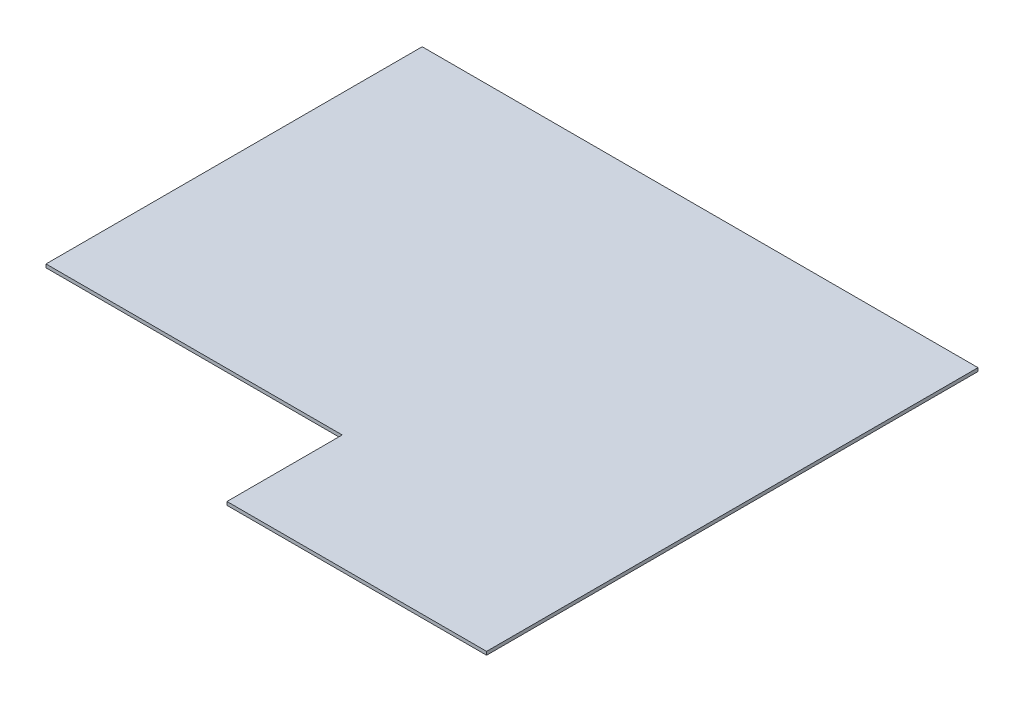
ISO-10303-21;
HEADER;
FILE_DESCRIPTION(('STEP AP214'),'2;1');
FILE_NAME('part.step','',(''),(''),'','','');
FILE_SCHEMA(('AUTOMOTIVE_DESIGN { 1 0 10303 214 1 1 1 1 }'));
ENDSEC;
DATA;
#1=APPLICATION_CONTEXT('core data for automotive mechanical design processes');
#2=APPLICATION_PROTOCOL_DEFINITION('international standard','automotive_design',2000,#1);
#3=PRODUCT_CONTEXT('',#1,'mechanical');
#4=PRODUCT('Part','Part','',(#3));
#5=PRODUCT_RELATED_PRODUCT_CATEGORY('part','',(#4));
#6=PRODUCT_DEFINITION_FORMATION('','',#4);
#7=PRODUCT_DEFINITION_CONTEXT('part definition',#1,'design');
#8=PRODUCT_DEFINITION('design','',#6,#7);
#9=PRODUCT_DEFINITION_SHAPE('','',#8);
#10=(LENGTH_UNIT() NAMED_UNIT(*) SI_UNIT(.MILLI.,.METRE.));
#11=(NAMED_UNIT(*) PLANE_ANGLE_UNIT() SI_UNIT($,.RADIAN.));
#12=(NAMED_UNIT(*) SI_UNIT($,.STERADIAN.) SOLID_ANGLE_UNIT());
#13=UNCERTAINTY_MEASURE_WITH_UNIT(LENGTH_MEASURE(1.E-05),#10,'distance_accuracy_value','');
#14=(GEOMETRIC_REPRESENTATION_CONTEXT(3) GLOBAL_UNCERTAINTY_ASSIGNED_CONTEXT((#13)) GLOBAL_UNIT_ASSIGNED_CONTEXT((#10,
#11,#12)) REPRESENTATION_CONTEXT('',''));
#15=CARTESIAN_POINT('',(0.,0.,0.));
#16=DIRECTION('',(0.,0.,1.));
#17=DIRECTION('',(1.,0.,0.));
#18=AXIS2_PLACEMENT_3D('',#15,#16,#17);
#19=CARTESIAN_POINT('',(0.,100.,-3400.));
#20=DIRECTION('',(1.,0.,0.));
#21=DIRECTION('',(0.,0.,-1.));
#22=AXIS2_PLACEMENT_3D('',#19,#20,#21);
#23=PLANE('',#22);
#24=DIRECTION('',(0.,0.,1.));
#25=VECTOR('',#24,1.);
#26=CARTESIAN_POINT('',(0.,0.,-3400.));
#27=LINE('',#26,#25);
#28=CARTESIAN_POINT('',(0.,0.,-14500.));
#29=VERTEX_POINT('',#28);
#30=CARTESIAN_POINT('',(0.,0.,-3400.));
#31=VERTEX_POINT('',#30);
#32=EDGE_CURVE('E118',#29,#31,#27,.T.);
#33=ORIENTED_EDGE('',*,*,#32,.T.);
#34=DIRECTION('',(0.,-1.,0.));
#35=VECTOR('',#34,1.);
#36=CARTESIAN_POINT('',(0.,100.,-3400.));
#37=LINE('',#36,#35);
#38=CARTESIAN_POINT('',(0.,100.,-3400.));
#39=VERTEX_POINT('',#38);
#40=EDGE_CURVE('E11',#39,#31,#37,.T.);
#41=ORIENTED_EDGE('',*,*,#40,.F.);
#42=DIRECTION('',(0.,0.,1.));
#43=VECTOR('',#42,1.);
#44=CARTESIAN_POINT('',(0.,100.,-3400.));
#45=LINE('',#44,#43);
#46=CARTESIAN_POINT('',(0.,100.,-14500.));
#47=VERTEX_POINT('',#46);
#48=EDGE_CURVE('E128',#47,#39,#45,.T.);
#49=ORIENTED_EDGE('',*,*,#48,.F.);
#50=DIRECTION('',(0.,-1.,0.));
#51=VECTOR('',#50,1.);
#52=CARTESIAN_POINT('',(0.,100.,-14500.));
#53=LINE('',#52,#51);
#54=EDGE_CURVE('E114',#47,#29,#53,.T.);
#55=ORIENTED_EDGE('',*,*,#54,.T.);
#56=EDGE_LOOP('',(#33,#41,#49,#55));
#57=FACE_BOUND('',#56,.T.);
#58=ADVANCED_FACE('F34',(#57),#23,.F.);
#59=CARTESIAN_POINT('',(8740.,100.,-3400.));
#60=DIRECTION('',(0.,0.,-1.));
#61=DIRECTION('',(-1.,0.,0.));
#62=AXIS2_PLACEMENT_3D('',#59,#60,#61);
#63=PLANE('',#62);
#64=DIRECTION('',(1.,0.,0.));
#65=VECTOR('',#64,1.);
#66=CARTESIAN_POINT('',(8740.,0.,-3400.));
#67=LINE('',#66,#65);
#68=CARTESIAN_POINT('',(8740.,0.,-3400.));
#69=VERTEX_POINT('',#68);
#70=EDGE_CURVE('E121',#31,#69,#67,.T.);
#71=ORIENTED_EDGE('',*,*,#70,.T.);
#72=DIRECTION('',(0.,-1.,0.));
#73=VECTOR('',#72,1.);
#74=CARTESIAN_POINT('',(8740.,100.,-3400.));
#75=LINE('',#74,#73);
#76=CARTESIAN_POINT('',(8740.,100.,-3400.));
#77=VERTEX_POINT('',#76);
#78=EDGE_CURVE('E42',#77,#69,#75,.T.);
#79=ORIENTED_EDGE('',*,*,#78,.F.);
#80=DIRECTION('',(1.,0.,0.));
#81=VECTOR('',#80,1.);
#82=CARTESIAN_POINT('',(8740.,100.,-3400.));
#83=LINE('',#82,#81);
#84=EDGE_CURVE('E87',#39,#77,#83,.T.);
#85=ORIENTED_EDGE('',*,*,#84,.F.);
#86=ORIENTED_EDGE('',*,*,#40,.T.);
#87=EDGE_LOOP('',(#71,#79,#85,#86));
#88=FACE_BOUND('',#87,.T.);
#89=ADVANCED_FACE('F152',(#88),#63,.F.);
#90=CARTESIAN_POINT('',(8740.,100.,7.81617874628674E-13));
#91=DIRECTION('',(1.,0.,0.));
#92=DIRECTION('',(0.,0.,-1.));
#93=AXIS2_PLACEMENT_3D('',#90,#91,#92);
#94=PLANE('',#93);
#95=DIRECTION('',(0.,0.,1.));
#96=VECTOR('',#95,1.);
#97=CARTESIAN_POINT('',(8740.,0.,7.81617874628674E-13));
#98=LINE('',#97,#96);
#99=CARTESIAN_POINT('',(8740.,0.,7.81617874628674E-13));
#100=VERTEX_POINT('',#99);
#101=EDGE_CURVE('E123',#69,#100,#98,.T.);
#102=ORIENTED_EDGE('',*,*,#101,.T.);
#103=DIRECTION('',(0.,-1.,0.));
#104=VECTOR('',#103,1.);
#105=CARTESIAN_POINT('',(8740.,100.,7.81617874628674E-13));
#106=LINE('',#105,#104);
#107=CARTESIAN_POINT('',(8740.,100.,7.81617874628674E-13));
#108=VERTEX_POINT('',#107);
#109=EDGE_CURVE('E109',#108,#100,#106,.T.);
#110=ORIENTED_EDGE('',*,*,#109,.F.);
#111=DIRECTION('',(0.,0.,1.));
#112=VECTOR('',#111,1.);
#113=CARTESIAN_POINT('',(8740.,100.,7.81617874628674E-13));
#114=LINE('',#113,#112);
#115=EDGE_CURVE('E100',#77,#108,#114,.T.);
#116=ORIENTED_EDGE('',*,*,#115,.F.);
#117=ORIENTED_EDGE('',*,*,#78,.T.);
#118=EDGE_LOOP('',(#102,#110,#116,#117));
#119=FACE_BOUND('',#118,.T.);
#120=ADVANCED_FACE('F134',(#119),#94,.F.);
#121=CARTESIAN_POINT('',(16400.,100.,-1.56461573518199E-13));
#122=DIRECTION('',(0.,0.,-1.));
#123=DIRECTION('',(-1.,0.,0.));
#124=AXIS2_PLACEMENT_3D('',#121,#122,#123);
#125=PLANE('',#124);
#126=DIRECTION('',(1.,0.,0.));
#127=VECTOR('',#126,1.);
#128=CARTESIAN_POINT('',(16400.,0.,-1.56461573518199E-13));
#129=LINE('',#128,#127);
#130=CARTESIAN_POINT('',(16400.,0.,-1.56461573518199E-13));
#131=VERTEX_POINT('',#130);
#132=EDGE_CURVE('E108',#100,#131,#129,.T.);
#133=ORIENTED_EDGE('',*,*,#132,.T.);
#134=DIRECTION('',(0.,-1.,0.));
#135=VECTOR('',#134,1.);
#136=CARTESIAN_POINT('',(16400.,100.,-1.56461573518199E-13));
#137=LINE('',#136,#135);
#138=CARTESIAN_POINT('',(16400.,100.,-1.56461573518199E-13));
#139=VERTEX_POINT('',#138);
#140=EDGE_CURVE('E105',#139,#131,#137,.T.);
#141=ORIENTED_EDGE('',*,*,#140,.F.);
#142=DIRECTION('',(1.,0.,0.));
#143=VECTOR('',#142,1.);
#144=CARTESIAN_POINT('',(16400.,100.,-1.56461573518199E-13));
#145=LINE('',#144,#143);
#146=EDGE_CURVE('E94',#108,#139,#145,.T.);
#147=ORIENTED_EDGE('',*,*,#146,.F.);
#148=ORIENTED_EDGE('',*,*,#109,.T.);
#149=EDGE_LOOP('',(#133,#141,#147,#148));
#150=FACE_BOUND('',#149,.T.);
#151=ADVANCED_FACE('F106',(#150),#125,.F.);
#152=CARTESIAN_POINT('',(16400.,100.,-14500.));
#153=DIRECTION('',(-1.,0.,0.));
#154=DIRECTION('',(0.,0.,1.));
#155=AXIS2_PLACEMENT_3D('',#152,#153,#154);
#156=PLANE('',#155);
#157=DIRECTION('',(0.,0.,-1.));
#158=VECTOR('',#157,1.);
#159=CARTESIAN_POINT('',(16400.,0.,-14500.));
#160=LINE('',#159,#158);
#161=CARTESIAN_POINT('',(16400.,0.,-14500.));
#162=VERTEX_POINT('',#161);
#163=EDGE_CURVE('E73',#131,#162,#160,.T.);
#164=ORIENTED_EDGE('',*,*,#163,.T.);
#165=DIRECTION('',(0.,-1.,0.));
#166=VECTOR('',#165,1.);
#167=CARTESIAN_POINT('',(16400.,100.,-14500.));
#168=LINE('',#167,#166);
#169=CARTESIAN_POINT('',(16400.,100.,-14500.));
#170=VERTEX_POINT('',#169);
#171=EDGE_CURVE('E110',#170,#162,#168,.T.);
#172=ORIENTED_EDGE('',*,*,#171,.F.);
#173=DIRECTION('',(0.,0.,-1.));
#174=VECTOR('',#173,1.);
#175=CARTESIAN_POINT('',(16400.,100.,-14500.));
#176=LINE('',#175,#174);
#177=EDGE_CURVE('E98',#139,#170,#176,.T.);
#178=ORIENTED_EDGE('',*,*,#177,.F.);
#179=ORIENTED_EDGE('',*,*,#140,.T.);
#180=EDGE_LOOP('',(#164,#172,#178,#179));
#181=FACE_BOUND('',#180,.T.);
#182=ADVANCED_FACE('F112',(#181),#156,.F.);
#183=CARTESIAN_POINT('',(0.,100.,-14500.));
#184=DIRECTION('',(0.,0.,1.));
#185=DIRECTION('',(1.,0.,0.));
#186=AXIS2_PLACEMENT_3D('',#183,#184,#185);
#187=PLANE('',#186);
#188=DIRECTION('',(-1.,0.,0.));
#189=VECTOR('',#188,1.);
#190=CARTESIAN_POINT('',(0.,0.,-14500.));
#191=LINE('',#190,#189);
#192=EDGE_CURVE('E79',#162,#29,#191,.T.);
#193=ORIENTED_EDGE('',*,*,#192,.T.);
#194=ORIENTED_EDGE('',*,*,#54,.F.);
#195=DIRECTION('',(-1.,0.,0.));
#196=VECTOR('',#195,1.);
#197=CARTESIAN_POINT('',(0.,100.,-14500.));
#198=LINE('',#197,#196);
#199=EDGE_CURVE('E50',#170,#47,#198,.T.);
#200=ORIENTED_EDGE('',*,*,#199,.F.);
#201=ORIENTED_EDGE('',*,*,#171,.T.);
#202=EDGE_LOOP('',(#193,#194,#200,#201));
#203=FACE_BOUND('',#202,.T.);
#204=ADVANCED_FACE('F141',(#203),#187,.F.);
#205=CARTESIAN_POINT('',(0.,100.,-14500.));
#206=DIRECTION('',(0.,-1.,0.));
#207=DIRECTION('',(0.,0.,-1.));
#208=AXIS2_PLACEMENT_3D('',#205,#206,#207);
#209=PLANE('',#208);
#210=ORIENTED_EDGE('',*,*,#48,.T.);
#211=ORIENTED_EDGE('',*,*,#84,.T.);
#212=ORIENTED_EDGE('',*,*,#115,.T.);
#213=ORIENTED_EDGE('',*,*,#146,.T.);
#214=ORIENTED_EDGE('',*,*,#177,.T.);
#215=ORIENTED_EDGE('',*,*,#199,.T.);
#216=EDGE_LOOP('',(#210,#211,#212,#213,#214,#215));
#217=FACE_BOUND('',#216,.T.);
#218=ADVANCED_FACE('F96',(#217),#209,.F.);
#219=CARTESIAN_POINT('',(0.,0.,-14500.));
#220=DIRECTION('',(0.,-1.,0.));
#221=DIRECTION('',(0.,0.,-1.));
#222=AXIS2_PLACEMENT_3D('',#219,#220,#221);
#223=PLANE('',#222);
#224=ORIENTED_EDGE('',*,*,#32,.F.);
#225=ORIENTED_EDGE('',*,*,#192,.F.);
#226=ORIENTED_EDGE('',*,*,#163,.F.);
#227=ORIENTED_EDGE('',*,*,#132,.F.);
#228=ORIENTED_EDGE('',*,*,#101,.F.);
#229=ORIENTED_EDGE('',*,*,#70,.F.);
#230=EDGE_LOOP('',(#224,#225,#226,#227,#228,#229));
#231=FACE_BOUND('',#230,.T.);
#232=ADVANCED_FACE('F137',(#231),#223,.T.);
#233=CLOSED_SHELL('',(#58,#89,#120,#151,#182,#204,#218,#232));
#234=MANIFOLD_SOLID_BREP('B2',#233);
#235=ADVANCED_BREP_SHAPE_REPRESENTATION('',(#18,#234),#14);
#236=SHAPE_DEFINITION_REPRESENTATION(#9,#235);
ENDSEC;
END-ISO-10303-21;
